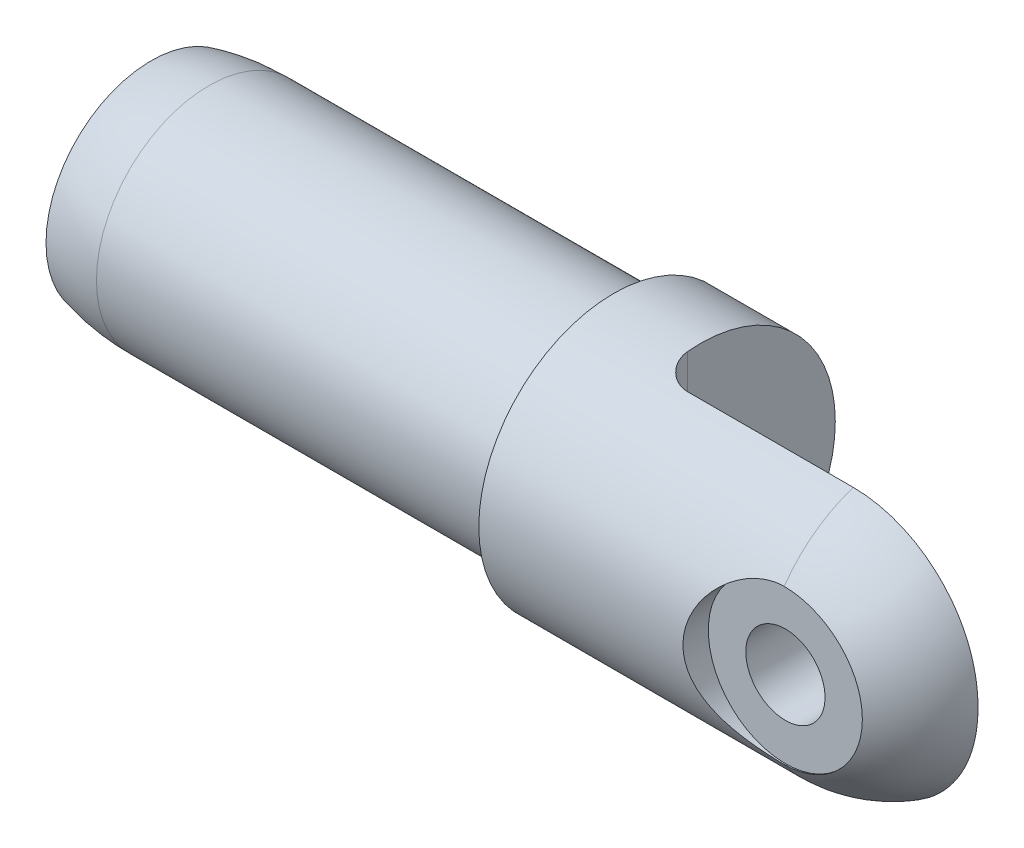
ISO-10303-21;
HEADER;
FILE_DESCRIPTION(('STEP AP214'),'2;1');
FILE_NAME('part.step','',(''),(''),'','','');
FILE_SCHEMA(('AUTOMOTIVE_DESIGN { 1 0 10303 214 1 1 1 1 }'));
ENDSEC;
DATA;
#1=APPLICATION_CONTEXT('core data for automotive mechanical design processes');
#2=APPLICATION_PROTOCOL_DEFINITION('international standard','automotive_design',2000,#1);
#3=PRODUCT_CONTEXT('',#1,'mechanical');
#4=PRODUCT('Part','Part','',(#3));
#5=PRODUCT_RELATED_PRODUCT_CATEGORY('part','',(#4));
#6=PRODUCT_DEFINITION_FORMATION('','',#4);
#7=PRODUCT_DEFINITION_CONTEXT('part definition',#1,'design');
#8=PRODUCT_DEFINITION('design','',#6,#7);
#9=PRODUCT_DEFINITION_SHAPE('','',#8);
#10=(LENGTH_UNIT() NAMED_UNIT(*) SI_UNIT(.MILLI.,.METRE.));
#11=(NAMED_UNIT(*) PLANE_ANGLE_UNIT() SI_UNIT($,.RADIAN.));
#12=(NAMED_UNIT(*) SI_UNIT($,.STERADIAN.) SOLID_ANGLE_UNIT());
#13=UNCERTAINTY_MEASURE_WITH_UNIT(LENGTH_MEASURE(1.E-05),#10,'distance_accuracy_value','');
#14=(GEOMETRIC_REPRESENTATION_CONTEXT(3) GLOBAL_UNCERTAINTY_ASSIGNED_CONTEXT((#13)) GLOBAL_UNIT_ASSIGNED_CONTEXT((#10,
#11,#12)) REPRESENTATION_CONTEXT('',''));
#15=CARTESIAN_POINT('',(0.,0.,0.));
#16=DIRECTION('',(0.,0.,1.));
#17=DIRECTION('',(1.,0.,0.));
#18=AXIS2_PLACEMENT_3D('',#15,#16,#17);
#19=CARTESIAN_POINT('',(4.11479999999999,0.,28.829));
#20=DIRECTION('',(0.,0.,-1.));
#21=DIRECTION('',(-1.,0.,0.));
#22=AXIS2_PLACEMENT_3D('',#19,#20,#21);
#23=CYLINDRICAL_SURFACE('',#22,3.2639);
#24=CARTESIAN_POINT('',(4.11479999999999,0.,3.429));
#25=DIRECTION('',(0.,0.,-1.));
#26=DIRECTION('',(-1.,0.,0.));
#27=AXIS2_PLACEMENT_3D('',#24,#25,#26);
#28=CIRCLE('',#27,3.2639);
#29=CARTESIAN_POINT('',(0.850899999999988,0.,3.429));
#30=VERTEX_POINT('',#29);
#31=EDGE_CURVE('E70',#30,#30,#28,.T.);
#32=ORIENTED_EDGE('',*,*,#31,.T.);
#33=EDGE_LOOP('',(#32));
#34=FACE_BOUND('',#33,.T.);
#35=CARTESIAN_POINT('',(4.11479999999999,0.,9.017));
#36=DIRECTION('',(0.,0.,-1.));
#37=DIRECTION('',(-1.,0.,0.));
#38=AXIS2_PLACEMENT_3D('',#35,#36,#37);
#39=CIRCLE('',#38,3.2639);
#40=CARTESIAN_POINT('',(0.850899999999988,0.,9.017));
#41=VERTEX_POINT('',#40);
#42=EDGE_CURVE('E19',#41,#41,#39,.F.);
#43=ORIENTED_EDGE('',*,*,#42,.T.);
#44=EDGE_LOOP('',(#43));
#45=FACE_BOUND('',#44,.T.);
#46=ADVANCED_FACE('F16',(#34,#45),#23,.F.);
#47=CARTESIAN_POINT('',(4.11479999999999,0.,9.017));
#48=DIRECTION('',(0.,0.,-1.));
#49=DIRECTION('',(-1.,0.,0.));
#50=AXIS2_PLACEMENT_3D('',#47,#48,#49);
#51=PLANE('',#50);
#52=ORIENTED_EDGE('',*,*,#42,.F.);
#53=EDGE_LOOP('',(#52));
#54=FACE_BOUND('',#53,.T.);
#55=CARTESIAN_POINT('',(4.11479999999999,0.,9.017));
#56=DIRECTION('',(0.,0.,1.));
#57=DIRECTION('',(1.,0.,0.));
#58=AXIS2_PLACEMENT_3D('',#55,#56,#57);
#59=CIRCLE('',#58,6.35);
#60=CARTESIAN_POINT('',(10.4648,0.,9.017));
#61=VERTEX_POINT('',#60);
#62=EDGE_CURVE('E100',#61,#61,#59,.T.);
#63=ORIENTED_EDGE('',*,*,#62,.T.);
#64=EDGE_LOOP('',(#63));
#65=FACE_BOUND('',#64,.T.);
#66=ADVANCED_FACE('F271',(#54,#65),#51,.F.);
#67=CARTESIAN_POINT('',(-17.5305929065692,0.,0.));
#68=DIRECTION('',(-1.,0.,0.));
#69=DIRECTION('',(0.,0.,1.));
#70=AXIS2_PLACEMENT_3D('',#67,#68,#69);
#71=CONICAL_SURFACE('',#70,6.34999999999985,1.17809724509603);
#72=CARTESIAN_POINT('',(-14.9003367854998,-2.88657986402541E-12,0.));
#73=VERTEX_POINT('',#72);
#74=VERTEX_LOOP('',#73);
#75=FACE_BOUND('',#74,.T.);
#76=CARTESIAN_POINT('',(-17.5305929065692,0.,0.));
#77=DIRECTION('',(1.,0.,0.));
#78=DIRECTION('',(0.,1.,0.));
#79=AXIS2_PLACEMENT_3D('',#76,#77,#78);
#80=CIRCLE('',#79,6.35);
#81=CARTESIAN_POINT('',(-17.5305929065692,6.35,0.));
#82=VERTEX_POINT('',#81);
#83=EDGE_CURVE('E172',#82,#82,#80,.F.);
#84=ORIENTED_EDGE('',*,*,#83,.T.);
#85=EDGE_LOOP('',(#84));
#86=FACE_BOUND('',#85,.T.);
#87=ADVANCED_FACE('F264',(#75,#86),#71,.F.);
#88=CARTESIAN_POINT('',(-11.90625,-25.4,-11.1125));
#89=DIRECTION('',(-1.,0.,0.));
#90=DIRECTION('',(0.,0.,1.));
#91=AXIS2_PLACEMENT_3D('',#88,#89,#90);
#92=PLANE('',#91);
#93=CARTESIAN_POINT('',(-11.90625,0.,0.));
#94=DIRECTION('',(-1.,0.,0.));
#95=DIRECTION('',(0.,0.,1.));
#96=AXIS2_PLACEMENT_3D('',#93,#94,#95);
#97=CIRCLE('',#96,11.1125);
#98=CARTESIAN_POINT('',(-11.90625,11.0629958052735,1.04774999999999));
#99=VERTEX_POINT('',#98);
#100=CARTESIAN_POINT('',(-11.90625,-11.0629958052735,1.04774999999998));
#101=VERTEX_POINT('',#100);
#102=EDGE_CURVE('E56',#99,#101,#97,.T.);
#103=ORIENTED_EDGE('',*,*,#102,.F.);
#104=DIRECTION('',(0.,1.,0.));
#105=VECTOR('',#104,1.);
#106=CARTESIAN_POINT('',(-11.90625,-25.4,1.04774999999998));
#107=LINE('',#106,#105);
#108=EDGE_CURVE('E64',#99,#101,#107,.F.);
#109=ORIENTED_EDGE('',*,*,#108,.T.);
#110=EDGE_LOOP('',(#103,#109));
#111=FACE_BOUND('',#110,.T.);
#112=ADVANCED_FACE('F66',(#111),#92,.F.);
#113=CARTESIAN_POINT('',(-9.525,-25.4,1.04775));
#114=DIRECTION('',(0.,1.,0.));
#115=DIRECTION('',(0.,0.,1.));
#116=AXIS2_PLACEMENT_3D('',#113,#114,#115);
#117=CYLINDRICAL_SURFACE('',#116,2.38125);
#118=ORIENTED_EDGE('',*,*,#108,.F.);
#119=CARTESIAN_POINT('',(-9.52499999999999,10.5702230463695,3.429));
#120=CARTESIAN_POINT('',(-9.59007757506837,10.5702157475828,3.42900820434887));
#121=CARTESIAN_POINT('',(-9.6551501934471,10.5710883130505,3.42633237813806));
#122=CARTESIAN_POINT('',(-9.78480089868392,10.574538719269,3.41567627561368));
#123=CARTESIAN_POINT('',(-9.8493790861965,10.5771162030687,3.40769710963494));
#124=CARTESIAN_POINT('',(-9.9774207812697,10.5839133732613,3.38652486966489));
#125=CARTESIAN_POINT('',(-10.040886707726,10.5881288629019,3.37334511882147));
#126=CARTESIAN_POINT('',(-10.1664067976909,10.5980944906147,3.34190357483902));
#127=CARTESIAN_POINT('',(-10.2284609303989,10.6038446621339,3.32364167093872));
#128=CARTESIAN_POINT('',(-10.4118261314781,10.6232034483166,3.26145883172233));
#129=CARTESIAN_POINT('',(-10.5304929254081,10.6389289097294,3.21011519315255));
#130=CARTESIAN_POINT('',(-10.7574606923266,10.674632334318,3.08930796096303));
#131=CARTESIAN_POINT('',(-10.8657571979252,10.6946121183613,3.01983660572699));
#132=CARTESIAN_POINT('',(-11.0723438695848,10.7378048676684,2.86252103470934));
#133=CARTESIAN_POINT('',(-11.1702675157826,10.7610928867535,2.77421554993913));
#134=CARTESIAN_POINT('',(-11.3501554532057,10.8086281716024,2.58281333569098));
#135=CARTESIAN_POINT('',(-11.432114988931,10.8328757206175,2.47971221462246));
#136=CARTESIAN_POINT('',(-11.5804798993483,10.8813670606136,2.25761808954577));
#137=CARTESIAN_POINT('',(-11.6462702287031,10.9055833588378,2.13820755936796));
#138=CARTESIAN_POINT('',(-11.7566403436888,10.9514037323377,1.88953875881115));
#139=CARTESIAN_POINT('',(-11.801235373844,10.9730096767192,1.7602876440474));
#140=CARTESIAN_POINT('',(-11.8582273537423,11.0066031116874,1.53345035197193));
#141=CARTESIAN_POINT('',(-11.8761838833356,11.0195747621923,1.43737154991012));
#142=CARTESIAN_POINT('',(-11.9002035242033,11.0431429738679,1.24350721882319));
#143=CARTESIAN_POINT('',(-11.9062728331179,11.053740770141,1.14572260600214));
#144=CARTESIAN_POINT('',(-11.90625,11.0629958052735,1.04774999999998));
#145=B_SPLINE_CURVE_WITH_KNOTS('',3,(#119,#120,#121,#122,#123,#124,#125,#126,#127,#128,#129,
#130,#131,#132,#133,#134,#135,#136,#137,#138,#139,#140,#141,#142,#143,#144),.UNSPECIFIED.,.F.,
.F.,(4,2,2,2,2,2,2,2,2,2,2,2,4),(0.,0.195163419909471,0.390285992254967,0.58491190075931,
0.779542051304854,1.16834236475339,1.55730942201975,1.95720233749974,2.35721419428481,
2.77066448351295,3.1838169507173,3.47889268061809,3.77381452588801),.UNSPECIFIED.);
#146=CARTESIAN_POINT('',(-9.52499999999999,10.5702230463695,3.429));
#147=VERTEX_POINT('',#146);
#148=EDGE_CURVE('E84',#147,#99,#145,.T.);
#149=ORIENTED_EDGE('',*,*,#148,.F.);
#150=DIRECTION('',(0.,1.,0.));
#151=VECTOR('',#150,1.);
#152=CARTESIAN_POINT('',(-9.52499999999999,-25.4,3.429));
#153=LINE('',#152,#151);
#154=CARTESIAN_POINT('',(-9.525,-10.5702230463695,3.429));
#155=VERTEX_POINT('',#154);
#156=EDGE_CURVE('E75',#147,#155,#153,.F.);
#157=ORIENTED_EDGE('',*,*,#156,.T.);
#158=CARTESIAN_POINT('',(-11.90625,-11.0629958052735,1.04774999999998));
#159=CARTESIAN_POINT('',(-11.9062503142858,-11.05663096206,1.11499195804934));
#160=CARTESIAN_POINT('',(-11.9034002135737,-11.049648757972,1.18213996736892));
#161=CARTESIAN_POINT('',(-11.8920647068507,-11.0345277624069,1.3158136794342));
#162=CARTESIAN_POINT('',(-11.8835804651633,-11.0263892101679,1.38233950787682));
#163=CARTESIAN_POINT('',(-11.8498349213216,-11.0003995321499,1.58001133523658));
#164=CARTESIAN_POINT('',(-11.8162800046308,-10.9809385541079,1.70962574663156));
#165=CARTESIAN_POINT('',(-11.7282515623074,-10.9388728295633,1.96086384995411));
#166=CARTESIAN_POINT('',(-11.6737834914026,-10.9162689038081,2.08248961586172));
#167=CARTESIAN_POINT('',(-11.5455335808344,-10.8693808252532,2.31479260695312));
#168=CARTESIAN_POINT('',(-11.4717455735568,-10.845096137719,2.42546632027547));
#169=CARTESIAN_POINT('',(-11.3051331874942,-10.7960916480259,2.63512866484038));
#170=CARTESIAN_POINT('',(-11.2119542128542,-10.7713729714463,2.73383592742652));
#171=CARTESIAN_POINT('',(-11.0098838607054,-10.7239701957526,2.91424756683147));
#172=CARTESIAN_POINT('',(-10.9009901123699,-10.7012864044726,2.99594937355288));
#173=CARTESIAN_POINT('',(-10.6703312526755,-10.6599424055754,3.13989031804794));
#174=CARTESIAN_POINT('',(-10.5485673354548,-10.6412818251584,3.20213125934963));
#175=CARTESIAN_POINT('',(-10.2955843570897,-10.6097878558335,3.30499270998591));
#176=CARTESIAN_POINT('',(-10.1643760027822,-10.5969479850908,3.34563727736996));
#177=CARTESIAN_POINT('',(-9.94761988754249,-10.5819352597564,3.39273567603477));
#178=CARTESIAN_POINT('',(-9.8637070188251,-10.5775623614962,3.40631529345634));
#179=CARTESIAN_POINT('',(-9.69487901693024,-10.5716990322974,3.42445095877389));
#180=CARTESIAN_POINT('',(-9.60996470253129,-10.5702063913584,3.42901392514501));
#181=CARTESIAN_POINT('',(-9.52499999999999,-10.5702230463695,3.429));
#182=B_SPLINE_CURVE_WITH_KNOTS('',3,(#158,#159,#160,#161,#162,#163,#164,#165,#166,#167,#168,
#169,#170,#171,#172,#173,#174,#175,#176,#177,#178,#179,#180,#181),.UNSPECIFIED.,.F.,.F.,(4,2,2,
2,2,2,2,2,2,2,2,4),(0.,0.202496246548069,0.404950659247399,0.808746853576956,1.21243779818405,
1.61625777283146,2.02823917714403,2.44028280059018,2.85228822672972,3.26383371737793,
3.51869225766275,3.77335516897302),.UNSPECIFIED.);
#183=EDGE_CURVE('E73',#101,#155,#182,.T.);
#184=ORIENTED_EDGE('',*,*,#183,.F.);
#185=EDGE_LOOP('',(#118,#149,#157,#184));
#186=FACE_BOUND('',#185,.T.);
#187=ADVANCED_FACE('F74',(#186),#117,.F.);
#188=CARTESIAN_POINT('',(14.3924863702392,-25.4,3.429));
#189=DIRECTION('',(0.,0.,1.));
#190=DIRECTION('',(1.,0.,0.));
#191=AXIS2_PLACEMENT_3D('',#188,#189,#190);
#192=PLANE('',#191);
#193=DIRECTION('',(-1.,0.,0.));
#194=VECTOR('',#193,1.);
#195=CARTESIAN_POINT('',(-57.15,10.5702230463695,3.429));
#196=LINE('',#195,#194);
#197=CARTESIAN_POINT('',(4.11479999999999,10.5702230463695,3.429));
#198=VERTEX_POINT('',#197);
#199=EDGE_CURVE('E86',#198,#147,#196,.T.);
#200=ORIENTED_EDGE('',*,*,#199,.F.);
#201=CARTESIAN_POINT('',(4.11479999999999,-10.5702230463695,3.42899999999999));
#202=CARTESIAN_POINT('',(4.40165968660357,-10.5702542669847,3.429));
#203=CARTESIAN_POINT('',(4.68851475117698,-10.5581144678676,3.429));
#204=CARTESIAN_POINT('',(5.26016903204297,-10.5097183984142,3.429));
#205=CARTESIAN_POINT('',(5.54496835385256,-10.473463374889,3.429));
#206=CARTESIAN_POINT('',(6.11026636516995,-10.3771012914387,3.429));
#207=CARTESIAN_POINT('',(6.39076834076853,-10.3170135096682,3.429));
#208=CARTESIAN_POINT('',(6.94571132720622,-10.1734279497175,3.429));
#209=CARTESIAN_POINT('',(7.22015240815029,-10.0899304424654,3.42899999999999));
#210=CARTESIAN_POINT('',(7.76115395037299,-9.90007853714298,3.42899999999999));
#211=CARTESIAN_POINT('',(8.0277107086402,-9.7937135869651,3.429));
#212=CARTESIAN_POINT('',(8.5509207277925,-9.55891521940781,3.429));
#213=CARTESIAN_POINT('',(8.80757397322663,-9.43048176759996,3.429));
#214=CARTESIAN_POINT('',(9.30911695395701,-9.15249427527941,3.429));
#215=CARTESIAN_POINT('',(9.55400871286386,-9.00294388559206,3.429));
#216=CARTESIAN_POINT('',(10.0303486024474,-8.6837822397422,3.429));
#217=CARTESIAN_POINT('',(10.2617967898724,-8.51417106826999,3.429));
#218=CARTESIAN_POINT('',(10.7098566926984,-8.15592413043585,3.429));
#219=CARTESIAN_POINT('',(10.9264529963244,-7.96726908936299,3.429));
#220=CARTESIAN_POINT('',(11.3430397319011,-7.57243862979385,3.429));
#221=CARTESIAN_POINT('',(11.5430301139773,-7.36626315868009,3.429));
#222=CARTESIAN_POINT('',(11.9250582161698,-6.93784480290657,3.429));
#223=CARTESIAN_POINT('',(12.1070931025427,-6.7155993916438,3.429));
#224=CARTESIAN_POINT('',(12.4519464452319,-6.25667422774999,3.429));
#225=CARTESIAN_POINT('',(12.6147650307728,-6.0199945722017,3.42899999999999));
#226=CARTESIAN_POINT('',(12.9209264615868,-5.53263777178276,3.42899999999999));
#227=CARTESIAN_POINT('',(13.0641634776673,-5.28189415657338,3.429));
#228=CARTESIAN_POINT('',(13.3292837928434,-4.76935429997244,3.429));
#229=CARTESIAN_POINT('',(13.4511663254719,-4.50755766227785,3.429));
#230=CARTESIAN_POINT('',(13.6728765928904,-3.97494112403004,3.429));
#231=CARTESIAN_POINT('',(13.7727145310807,-3.70412546503607,3.429));
#232=CARTESIAN_POINT('',(13.9500298915372,-3.15530997529808,3.429));
#233=CARTESIAN_POINT('',(14.0275106924218,-2.8773112369891,3.429));
#234=CARTESIAN_POINT('',(14.144000761436,-2.38415885849262,3.429));
#235=CARTESIAN_POINT('',(14.1877830557638,-2.17011616363708,3.429));
#236=CARTESIAN_POINT('',(14.2626195594898,-1.73981924070847,3.429));
#237=CARTESIAN_POINT('',(14.2936740885204,-1.52356506831208,3.429));
#238=CARTESIAN_POINT('',(14.3432163652892,-1.08976886113074,3.429));
#239=CARTESIAN_POINT('',(14.3617123232824,-0.872227761712938,3.429));
#240=CARTESIAN_POINT('',(14.3863456522571,-0.436468474403662,3.429));
#241=CARTESIAN_POINT('',(14.3924831050723,-0.218250291005173,3.429));
#242=CARTESIAN_POINT('',(14.3924917436325,0.359168368235225,3.429));
#243=CARTESIAN_POINT('',(14.3758842894535,0.718423691445449,3.429));
#244=CARTESIAN_POINT('',(14.3088929867436,1.43393980071099,3.429));
#245=CARTESIAN_POINT('',(14.2584945050238,1.79019922168611,3.429));
#246=CARTESIAN_POINT('',(14.1340944808747,2.43873442118711,3.429));
#247=CARTESIAN_POINT('',(14.0652554100939,2.7320050653158,3.429));
#248=CARTESIAN_POINT('',(13.9031387336199,3.31181801287049,3.429));
#249=CARTESIAN_POINT('',(13.8098550632279,3.59835862732778,3.429));
#250=CARTESIAN_POINT('',(13.5990120314003,4.16267192989558,3.429));
#251=CARTESIAN_POINT('',(13.4814305276417,4.44043635230689,3.429));
#252=CARTESIAN_POINT('',(13.2226570398721,4.98472807794138,3.429));
#253=CARTESIAN_POINT('',(13.0814665572953,5.25125609440504,3.429));
#254=CARTESIAN_POINT('',(12.7779629229675,5.76827349609684,3.429));
#255=CARTESIAN_POINT('',(12.6158851327536,6.01890103617935,3.429));
#256=CARTESIAN_POINT('',(12.2705978457698,6.50516088144595,3.429));
#257=CARTESIAN_POINT('',(12.0873880489295,6.74079297362383,3.429));
#258=CARTESIAN_POINT('',(11.7012239560847,7.19514789430687,3.429));
#259=CARTESIAN_POINT('',(11.4982762039422,7.41387628414577,3.429));
#260=CARTESIAN_POINT('',(11.0740878296009,7.83280568308689,3.429));
#261=CARTESIAN_POINT('',(10.8528476719938,8.03300716246309,3.429));
#262=CARTESIAN_POINT('',(10.4007596821611,8.40751011476593,3.429));
#263=CARTESIAN_POINT('',(10.1704124762138,8.58241635516515,3.429));
#264=CARTESIAN_POINT('',(9.69572902425788,8.91207920814252,3.429));
#265=CARTESIAN_POINT('',(9.45139310695082,9.06683629389846,3.429));
#266=CARTESIAN_POINT('',(8.95043801593031,9.35509516622299,3.429));
#267=CARTESIAN_POINT('',(8.69381693626368,9.48859364068318,3.429));
#268=CARTESIAN_POINT('',(8.17017042465508,9.7333319176702,3.429));
#269=CARTESIAN_POINT('',(7.90314487237041,9.84457146264911,3.429));
#270=CARTESIAN_POINT('',(7.3511985739832,10.0474358962125,3.429));
#271=CARTESIAN_POINT('',(7.06597836705986,10.1382471017149,3.429));
#272=CARTESIAN_POINT('',(6.48865116990716,10.2944612702724,3.429));
#273=CARTESIAN_POINT('',(6.19654386176869,10.3598630579817,3.429));
#274=CARTESIAN_POINT('',(5.60733488091136,10.464797566013,3.429));
#275=CARTESIAN_POINT('',(5.31022732563008,10.5042972606353,3.429));
#276=CARTESIAN_POINT('',(4.71368167088168,10.5570290073484,3.429));
#277=CARTESIAN_POINT('',(4.41424349788154,10.5702602272454,3.429));
#278=CARTESIAN_POINT('',(4.11479999999999,10.5702230463695,3.429));
#279=B_SPLINE_CURVE_WITH_KNOTS('',3,(#201,#202,#203,#204,#205,#206,#207,#208,#209,#210,#211,
#212,#213,#214,#215,#216,#217,#218,#219,#220,#221,#222,#223,#224,#225,#226,#227,#228,#229,#230,
#231,#232,#233,#234,#235,#236,#237,#238,#239,#240,#241,#242,#243,#244,#245,#246,#247,#248,#249,
#250,#251,#252,#253,#254,#255,#256,#257,#258,#259,#260,#261,#262,#263,#264,#265,#266,#267,#268,
#269,#270,#271,#272,#273,#274,#275,#276,#277,#278),.UNSPECIFIED.,.F.,.F.,(4,2,2,2,2,2,2,2,2,2,2,
2,2,2,2,2,2,2,2,2,2,2,2,2,2,2,2,2,2,2,2,2,2,2,2,2,2,2,4),(0.,0.860315744735405,1.7205870126791,
2.58016382763194,3.4397306948461,4.29969506103299,5.15966076883799,6.01947798213552,
6.87929156568523,7.73998428064422,8.60067958053258,9.46151049908485,10.3223356284453,
11.1876432587396,12.0529819407878,12.9179192549652,13.7827257909746,14.4377828883006,
15.0928235341626,15.7474355291582,16.4020431895328,17.4793126132215,18.5570488495088,
19.4597570237978,20.362689372142,21.2664482094375,22.1701495932272,23.0644369107593,
23.9587369285625,24.8527414570636,25.7467232865588,26.6133697069945,27.479995771646,
28.3467567254966,29.2135277076627,30.1103474836706,31.0072087383095,31.9052112974357,
32.8032423051164),.UNSPECIFIED.);
#280=CARTESIAN_POINT('',(4.11479999999999,-10.5702230463695,3.429));
#281=VERTEX_POINT('',#280);
#282=EDGE_CURVE('E45',#281,#198,#279,.T.);
#283=ORIENTED_EDGE('',*,*,#282,.F.);
#284=DIRECTION('',(-1.,0.,0.));
#285=VECTOR('',#284,1.);
#286=CARTESIAN_POINT('',(-57.15,-10.5702230463695,3.429));
#287=LINE('',#286,#285);
#288=EDGE_CURVE('E79',#155,#281,#287,.F.);
#289=ORIENTED_EDGE('',*,*,#288,.F.);
#290=ORIENTED_EDGE('',*,*,#156,.F.);
#291=EDGE_LOOP('',(#200,#283,#289,#290));
#292=FACE_BOUND('',#291,.T.);
#293=ORIENTED_EDGE('',*,*,#31,.F.);
#294=EDGE_LOOP('',(#293));
#295=FACE_BOUND('',#294,.T.);
#296=ADVANCED_FACE('F141',(#292,#295),#192,.F.);
#297=CARTESIAN_POINT('',(4.11479999999998,0.,0.396874999999999));
#298=DIRECTION('',(0.,1.,0.));
#299=DIRECTION('',(0.,0.,1.));
#300=AXIS2_PLACEMENT_3D('',#297,#298,#299);
#301=CIRCLE('',#300,10.715625);
#302=TRIMMED_CURVE('',#301,(PARAMETER_VALUE(-1.60784183660699)),
(PARAMETER_VALUE(1.60784183660699)),.T.,.PARAMETER.);
#303=CARTESIAN_POINT('',(4.11479999999998,0.,0.));
#304=DIRECTION('',(-1.,0.,0.));
#305=AXIS1_PLACEMENT('',#303,#304);
#306=SURFACE_OF_REVOLUTION('',#302,#305);
#307=CARTESIAN_POINT('',(4.11479999999999,6.34999999999999,9.11949320137912));
#308=CARTESIAN_POINT('',(4.29336021298781,6.35001923466306,9.1194946397849));
#309=CARTESIAN_POINT('',(4.47191762888058,6.34246921342302,9.11929902288398));
#310=CARTESIAN_POINT('',(4.82775451313722,6.31236960883699,9.11852401486109));
#311=CARTESIAN_POINT('',(5.00503404357307,6.28982075907454,9.11794464250838));
#312=CARTESIAN_POINT('',(5.35693570714954,6.2298836798212,9.11641300132261));
#313=CARTESIAN_POINT('',(5.53155963548152,6.19250598409405,9.11546099719728));
#314=CARTESIAN_POINT('',(5.87703653491204,6.10318364067847,9.11320451066068));
#315=CARTESIAN_POINT('',(6.04788955107782,6.05123916718356,9.11190003246441));
#316=CARTESIAN_POINT('',(6.38466376101032,5.93313330116117,9.10896596967149));
#317=CARTESIAN_POINT('',(6.55058345853274,5.86696764451125,9.10733628757524));
#318=CARTESIAN_POINT('',(6.87631878044994,5.7208729412379,9.10378734414069));
#319=CARTESIAN_POINT('',(7.03613213399613,5.64093883406532,9.10186797636158));
#320=CARTESIAN_POINT('',(7.34838683826885,5.46793025557099,9.09778476756792));
#321=CARTESIAN_POINT('',(7.5008313405531,5.37486146973727,9.09562103241098));
#322=CARTESIAN_POINT('',(7.79734308469577,5.17621693935109,9.09109972826269));
#323=CARTESIAN_POINT('',(7.94141014709172,5.07064092701447,9.08874215512153));
#324=CARTESIAN_POINT('',(8.22015728392766,4.84772046354233,9.08389152309223));
#325=CARTESIAN_POINT('',(8.35483625300749,4.73037463057418,9.08139844831133));
#326=CARTESIAN_POINT('',(8.6138326326601,4.48475830452535,9.07634227813275));
#327=CARTESIAN_POINT('',(8.73815003697446,4.35648780484624,9.07377918269278));
#328=CARTESIAN_POINT('',(8.97558750389792,4.08988035612624,9.0686527844017));
#329=CARTESIAN_POINT('',(9.0887031394057,3.95153946430133,9.06608948186612));
#330=CARTESIAN_POINT('',(9.30287541986637,3.66582174289506,9.0610388071297));
#331=CARTESIAN_POINT('',(9.40393231391045,3.51844510005578,9.05855143336124));
#332=CARTESIAN_POINT('',(9.59334669592494,3.21557960738187,9.05372788505043));
#333=CARTESIAN_POINT('',(9.68169405261612,3.06008441902103,9.05139183193826));
#334=CARTESIAN_POINT('',(9.84493471710065,2.74225484884581,9.04695084951367));
#335=CARTESIAN_POINT('',(9.91983290631086,2.57992297494488,9.04484583645283));
#336=CARTESIAN_POINT('',(10.0556228907626,2.24965999099767,9.04094086822662));
#337=CARTESIAN_POINT('',(10.1165267498227,2.08173384758559,9.03914065066718));
#338=CARTESIAN_POINT('',(10.223962599642,1.74140088218761,9.0359090236737));
#339=CARTESIAN_POINT('',(10.2704980435776,1.56899514760202,9.03447752563865));
#340=CARTESIAN_POINT('',(10.3611753287635,1.16627248752879,9.03165517957172));
#341=CARTESIAN_POINT('',(10.3999980316597,0.934737097151482,9.03041762161556));
#342=CARTESIAN_POINT('',(10.4518095059542,0.468785926322722,9.02875816734439));
#343=CARTESIAN_POINT('',(10.4647977619294,0.234370088497342,9.02833628730298));
#344=CARTESIAN_POINT('',(10.4648017029684,-0.178334346276048,9.0283357962919));
#345=CARTESIAN_POINT('',(10.4572847256569,-0.356642204480613,9.02857968394109));
#346=CARTESIAN_POINT('',(10.4272708249356,-0.712048587792949,9.02954502285182));
#347=CARTESIAN_POINT('',(10.4047703109932,-0.889146812755241,9.03026658857999));
#348=CARTESIAN_POINT('',(10.3449205422979,-1.24095296213089,9.03215967788938));
#349=CARTESIAN_POINT('',(10.3075596550775,-1.41565890281434,9.03333155394204));
#350=CARTESIAN_POINT('',(10.218239926485,-1.761364209099,9.03608012133331));
#351=CARTESIAN_POINT('',(10.1662757625657,-1.93236219871682,9.0376569602532));
#352=CARTESIAN_POINT('',(10.0481744142551,-2.26922872140831,9.04115465691044));
#353=CARTESIAN_POINT('',(9.98204898445259,-2.43510137889895,9.04307522911537));
#354=CARTESIAN_POINT('',(9.83604264941287,-2.76074904775144,9.04719325738053));
#355=CARTESIAN_POINT('',(9.75615661509811,-2.9205217582159,9.04939081660167));
#356=CARTESIAN_POINT('',(9.5832677155704,-3.23267280670186,9.05398603765447));
#357=CARTESIAN_POINT('',(9.4902729970317,-3.38505565884966,9.05638357483052));
#358=CARTESIAN_POINT('',(9.29174438242254,-3.68151971089567,9.06130397837));
#359=CARTESIAN_POINT('',(9.18620482402368,-3.8255971180861,9.06382690102707));
#360=CARTESIAN_POINT('',(8.96329963459932,-4.10444043190065,9.06892208649419));
#361=CARTESIAN_POINT('',(8.84592664673014,-4.23920045705792,9.07149437918308));
#362=CARTESIAN_POINT('',(8.60029934833327,-4.49829376460357,9.07661186072623));
#363=CARTESIAN_POINT('',(8.47204998358188,-4.62263173557275,9.07915706131365));
#364=CARTESIAN_POINT('',(8.20546906899901,-4.86012438744001,9.08415387617797));
#365=CARTESIAN_POINT('',(8.06713260900708,-4.97327355789752,9.08660544397989));
#366=CARTESIAN_POINT('',(7.78146972581167,-5.1874746146652,9.09134982537107));
#367=CARTESIAN_POINT('',(7.63414668099082,-5.28853100528755,9.09364269793604));
#368=CARTESIAN_POINT('',(7.33140241363462,-5.47794426795067,9.09801622671243));
#369=CARTESIAN_POINT('',(7.17597554073038,-5.56629211320329,9.10009673177912));
#370=CARTESIAN_POINT('',(6.85828541544906,-5.72954389774143,9.10399425681801));
#371=CARTESIAN_POINT('',(6.69602467896333,-5.80445273210169,9.10581137268155));
#372=CARTESIAN_POINT('',(6.36579434916114,-5.94031883949376,9.1091417478085));
#373=CARTESIAN_POINT('',(6.19782598586264,-6.00127909687722,9.11065507206078));
#374=CARTESIAN_POINT('',(5.85741457788779,-6.10881893199277,9.11334504154765));
#375=CARTESIAN_POINT('',(5.68497261778809,-6.15540196065823,9.11452176757018));
#376=CARTESIAN_POINT('',(5.281825284567,-6.24624627336825,9.11682776424876));
#377=CARTESIAN_POINT('',(5.04987769801229,-6.28515387596483,9.11782532256507));
#378=CARTESIAN_POINT('',(4.70009366961108,-6.32405755669483,9.11882485239718));
#379=CARTESIAN_POINT('',(4.58325139859289,-6.33378248745614,9.11907522640062));
#380=CARTESIAN_POINT('',(4.34921570548934,-6.3467529048538,9.1194094409669));
#381=CARTESIAN_POINT('',(4.23202230859598,-6.34999884568939,9.11949329320349));
#382=CARTESIAN_POINT('',(4.11479999999999,-6.35,9.11949320137912));
#383=B_SPLINE_CURVE_WITH_KNOTS('',3,(#307,#308,#309,#310,#311,#312,#313,#314,#315,#316,#317,
#318,#319,#320,#321,#322,#323,#324,#325,#326,#327,#328,#329,#330,#331,#332,#333,#334,#335,#336,
#337,#338,#339,#340,#341,#342,#343,#344,#345,#346,#347,#348,#349,#350,#351,#352,#353,#354,#355,
#356,#357,#358,#359,#360,#361,#362,#363,#364,#365,#366,#367,#368,#369,#370,#371,#372,#373,#374,
#375,#376,#377,#378,#379,#380,#381,#382),.UNSPECIFIED.,.F.,.F.,(4,2,2,2,2,2,2,2,2,2,2,2,2,2,2,2,
2,2,2,2,2,2,2,2,2,2,2,2,2,2,2,2,2,2,2,2,2,4),(0.,0.535517031355501,1.07100787282515,
1.60611900416649,2.14122373677483,2.67648914119134,3.21195170210855,3.74718318913139,
4.28242613772267,4.81773200008979,5.35303818578202,5.88855509492011,6.42406094024674,
6.95999132097504,7.49572678920089,8.03099867913615,8.56614182629892,9.2689698813817,
9.97181195844746,10.5066109302465,11.0415381030502,11.5768848351507,12.1124269420402,
12.647526232193,13.1828254066106,13.7177933626124,14.2530037091087,14.7885488721324,
15.3238518011353,15.8594170652641,16.3947822172508,16.9305257771685,17.4660737979261,
18.0015071287612,18.5368118406278,19.2407397488779,19.5923286654551,19.9438929335876),.UNSPECIFIED.);
#384=CARTESIAN_POINT('',(4.11479999999999,6.34999999999999,9.11949320137912));
#385=VERTEX_POINT('',#384);
#386=CARTESIAN_POINT('',(4.11479999999999,-6.35,9.11949320137911));
#387=VERTEX_POINT('',#386);
#388=EDGE_CURVE('E34',#385,#387,#383,.T.);
#389=ORIENTED_EDGE('',*,*,#388,.T.);
#390=CARTESIAN_POINT('',(4.11479999999999,0.,0.));
#391=DIRECTION('',(-1.,0.,0.));
#392=DIRECTION('',(0.,0.,1.));
#393=AXIS2_PLACEMENT_3D('',#390,#391,#392);
#394=CIRCLE('',#393,11.1125);
#395=EDGE_CURVE('E122',#281,#387,#394,.T.);
#396=ORIENTED_EDGE('',*,*,#395,.F.);
#397=ORIENTED_EDGE('',*,*,#282,.T.);
#398=CARTESIAN_POINT('',(4.11479999999999,0.,0.));
#399=DIRECTION('',(-1.,0.,0.));
#400=DIRECTION('',(0.,0.,1.));
#401=AXIS2_PLACEMENT_3D('',#398,#399,#400);
#402=CIRCLE('',#401,11.1125);
#403=EDGE_CURVE('E170',#385,#198,#402,.T.);
#404=ORIENTED_EDGE('',*,*,#403,.F.);
#405=EDGE_LOOP('',(#389,#396,#397,#404));
#406=FACE_BOUND('',#405,.T.);
#407=ADVANCED_FACE('F128',(#406),#306,.F.);
#408=CARTESIAN_POINT('',(4.11479999999999,0.,9.017));
#409=DIRECTION('',(0.,0.,1.));
#410=DIRECTION('',(1.,0.,0.));
#411=AXIS2_PLACEMENT_3D('',#408,#409,#410);
#412=CYLINDRICAL_SURFACE('',#411,6.35);
#413=ORIENTED_EDGE('',*,*,#388,.F.);
#414=CARTESIAN_POINT('',(4.11479999999999,-6.35,9.11949320137911));
#415=CARTESIAN_POINT('',(3.95245147831902,-6.35003519286683,9.11943048182426));
#416=CARTESIAN_POINT('',(3.7901350995733,-6.34377567787408,9.1238265282677));
#417=CARTESIAN_POINT('',(3.46703343699066,-6.31894035290302,9.14106458580629));
#418=CARTESIAN_POINT('',(3.30624696446664,-6.30037506080813,9.15389938413161));
#419=CARTESIAN_POINT('',(2.98855507299971,-6.25138010242326,9.18742194746135));
#420=CARTESIAN_POINT('',(2.83162988086414,-6.2210381131115,9.20805165036083));
#421=CARTESIAN_POINT('',(2.52152457443068,-6.14892797533445,9.2563617994105));
#422=CARTESIAN_POINT('',(2.3683451080343,-6.10715786515491,9.28404345602));
#423=CARTESIAN_POINT('',(2.06717315689365,-6.01286457967159,9.34538705161209));
#424=CARTESIAN_POINT('',(1.91916467519649,-5.96037879948081,9.37902814099676));
#425=CARTESIAN_POINT('',(1.62845594459035,-5.84508896320999,9.45130791300472));
#426=CARTESIAN_POINT('',(1.48575778936575,-5.78228088916351,9.48994854045388));
#427=CARTESIAN_POINT('',(1.06610174081408,-5.57894607622708,9.61186824936912));
#428=CARTESIAN_POINT('',(0.797910164280768,-5.42361274537789,9.70107430026862));
#429=CARTESIAN_POINT('',(0.260813102150916,-5.05826023783404,9.89692036539756));
#430=CARTESIAN_POINT('',(-0.00498658994943469,-4.84412682022318,10.004400921062));
#431=CARTESIAN_POINT('',(-0.375576637055676,-4.49310751043241,10.1644615930314));
#432=CARTESIAN_POINT('',(-0.494478369234897,-4.37105719398525,10.2176502134535));
#433=CARTESIAN_POINT('',(-0.722433483902645,-4.11737103538705,10.3224863778028));
#434=CARTESIAN_POINT('',(-0.831485281307482,-3.98573365658939,10.3741336728027));
#435=CARTESIAN_POINT('',(-1.04900099016503,-3.70038527562882,10.4795085508888));
#436=CARTESIAN_POINT('',(-1.15641046809246,-3.54576734348305,10.5329624161366));
#437=CARTESIAN_POINT('',(-1.3576451640528,-3.22651909983752,10.635097517204));
#438=CARTESIAN_POINT('',(-1.45147603154476,-3.06189299301659,10.6837807351413));
#439=CARTESIAN_POINT('',(-1.62455305890763,-2.72367101528932,10.7749674605877));
#440=CARTESIAN_POINT('',(-1.70381083842544,-2.55008243318784,10.8174758857519));
#441=CARTESIAN_POINT('',(-1.84681559071721,-2.19504825948408,10.8950633421832));
#442=CARTESIAN_POINT('',(-1.91056672420157,-2.01360479091433,10.9301443660266));
#443=CARTESIAN_POINT('',(-2.01027703062813,-1.68210374062236,10.985462291376));
#444=CARTESIAN_POINT('',(-2.04925324836555,-1.53320777043884,11.0072676249276));
#445=CARTESIAN_POINT('',(-2.11639185281486,-1.23227571076992,11.0450049590811));
#446=CARTESIAN_POINT('',(-2.14455597623116,-1.0802401297257,11.0609379029256));
#447=CARTESIAN_POINT('',(-2.18974342236131,-0.774060791566224,11.0865719593518));
#448=CARTESIAN_POINT('',(-2.20677109524749,-0.619917881675709,11.0962755052626));
#449=CARTESIAN_POINT('',(-2.22949992716548,-0.310518168652721,11.109239885208));
#450=CARTESIAN_POINT('',(-2.23520030767384,-0.155261289693234,11.1125002764053));
#451=CARTESIAN_POINT('',(-2.23519967493533,0.164037229841071,11.1124997079712));
#452=CARTESIAN_POINT('',(-2.22883600060636,0.328079383129707,11.1088597208518));
#453=CARTESIAN_POINT('',(-2.20346836533585,0.6548640679492,11.0943933554963));
#454=CARTESIAN_POINT('',(-2.18446391842137,0.817606549270889,11.0835667009697));
#455=CARTESIAN_POINT('',(-2.13406513780724,1.14057045949559,11.0550007284814));
#456=CARTESIAN_POINT('',(-2.10266858163059,1.30079143081259,11.0372601705448));
#457=CARTESIAN_POINT('',(-2.02786897100461,1.61759848301998,10.9952981312375));
#458=CARTESIAN_POINT('',(-1.98446093892674,1.77418302773017,10.971073963156));
#459=CARTESIAN_POINT('',(-1.88635815672554,2.08196249222761,10.9168397627607));
#460=CARTESIAN_POINT('',(-1.83171391417426,2.23317809682437,10.8868556601256));
#461=CARTESIAN_POINT('',(-1.71158296088921,2.53010849904803,10.8217077617134));
#462=CARTESIAN_POINT('',(-1.64609207868185,2.6758211537338,10.7865419737052));
#463=CARTESIAN_POINT('',(-1.43425205853039,3.10347751810646,10.6743943356217));
#464=CARTESIAN_POINT('',(-1.27245225697282,3.37619767218739,10.5907148215407));
#465=CARTESIAN_POINT('',(-0.899524302232207,3.91062262230077,10.4057917801407));
#466=CARTESIAN_POINT('',(-0.685684886219577,4.1701236362276,10.3037177793726));
#467=CARTESIAN_POINT('',(-0.220474367793522,4.6518887633142,10.0953685264426));
#468=CARTESIAN_POINT('',(0.0309448615448155,4.87410434045918,9.98908801740414));
#469=CARTESIAN_POINT('',(0.447521363862742,5.18731241047899,9.82829170156993));
#470=CARTESIAN_POINT('',(0.601299423345375,5.29270534371552,9.77178010180995));
#471=CARTESIAN_POINT('',(0.918526971376583,5.49010218289477,9.66225413807853));
#472=CARTESIAN_POINT('',(1.08197882542341,5.58210279487601,9.60924063624265));
#473=CARTESIAN_POINT('',(1.41730356027459,5.75162828631799,9.50873950743427));
#474=CARTESIAN_POINT('',(1.5891543609773,5.82918878914918,9.46123839371472));
#475=CARTESIAN_POINT('',(1.94060516051379,5.96917972223046,9.37354659236085));
#476=CARTESIAN_POINT('',(2.12019926686161,6.03162142625669,9.33335046316406));
#477=CARTESIAN_POINT('',(2.44773364092394,6.1291259389783,9.26952653377587));
#478=CARTESIAN_POINT('',(2.59445571700668,6.16718309231781,9.2441917032362));
#479=CARTESIAN_POINT('',(2.89116028688102,6.23283915898145,9.20005057494133));
#480=CARTESIAN_POINT('',(3.04114178938115,6.26044120623136,9.18124232098201));
#481=CARTESIAN_POINT('',(3.34438378481543,6.30496328683832,9.15073071866757));
#482=CARTESIAN_POINT('',(3.49765899938053,6.32181479476149,9.13907296639487));
#483=CARTESIAN_POINT('',(3.80554671415482,6.34435249518381,9.12342497113931));
#484=CARTESIAN_POINT('',(3.9601602587387,6.35002899298102,9.11944138582184));
#485=CARTESIAN_POINT('',(4.11479999999999,6.34999999999999,9.11949320137912));
#486=B_SPLINE_CURVE_WITH_KNOTS('',3,(#414,#415,#416,#417,#418,#419,#420,#421,#422,#423,#424,
#425,#426,#427,#428,#429,#430,#431,#432,#433,#434,#435,#436,#437,#438,#439,#440,#441,#442,#443,
#444,#445,#446,#447,#448,#449,#450,#451,#452,#453,#454,#455,#456,#457,#458,#459,#460,#461,#462,
#463,#464,#465,#466,#467,#468,#469,#470,#471,#472,#473,#474,#475,#476,#477,#478,#479,#480,#481,
#482,#483,#484,#485),.UNSPECIFIED.,.F.,.F.,(4,2,2,2,2,2,2,2,2,2,2,2,2,2,2,2,2,2,2,2,2,2,2,2,2,2,
2,2,2,2,2,2,2,2,2,4),(0.,0.486814545000233,0.973213539847835,1.45605870769001,1.9389868112302,
2.42025756680202,2.90171610328713,3.86567559786668,4.93466035610752,5.46973123871397,
6.00488807383573,6.59124502858293,7.17735732040123,7.76300023786519,8.34848584309138,
8.8143489085206,9.28013711284772,9.74574325996674,10.2113814070347,10.7033391378011,
11.1953157829146,11.687380702264,12.1796498424791,12.6697527608309,13.1600446058174,
14.1398118027008,15.1900617221904,16.2416683640788,16.8254745964612,17.4094241794747,
17.9919135117631,18.5739671467923,19.0345192800438,19.4949332529989,19.9582533948281,
20.4219753058435),.UNSPECIFIED.);
#487=EDGE_CURVE('E115',#387,#385,#486,.T.);
#488=ORIENTED_EDGE('',*,*,#487,.F.);
#489=EDGE_LOOP('',(#413,#488));
#490=FACE_BOUND('',#489,.T.);
#491=ORIENTED_EDGE('',*,*,#62,.F.);
#492=EDGE_LOOP('',(#491));
#493=FACE_BOUND('',#492,.T.);
#494=ADVANCED_FACE('F124',(#490,#493),#412,.F.);
#495=CARTESIAN_POINT('',(-14.9003367855,0.,0.));
#496=DIRECTION('',(1.,0.,0.));
#497=DIRECTION('',(0.,1.,0.));
#498=AXIS2_PLACEMENT_3D('',#495,#496,#497);
#499=CYLINDRICAL_SURFACE('',#498,6.35);
#500=CARTESIAN_POINT('',(-57.15,0.,0.));
#501=DIRECTION('',(1.,0.,0.));
#502=DIRECTION('',(0.,1.,0.));
#503=AXIS2_PLACEMENT_3D('',#500,#501,#502);
#504=CIRCLE('',#503,6.35);
#505=CARTESIAN_POINT('',(-57.15,6.35,0.));
#506=VERTEX_POINT('',#505);
#507=EDGE_CURVE('E121',#506,#506,#504,.F.);
#508=ORIENTED_EDGE('',*,*,#507,.T.);
#509=EDGE_LOOP('',(#508));
#510=FACE_BOUND('',#509,.T.);
#511=ORIENTED_EDGE('',*,*,#83,.F.);
#512=EDGE_LOOP('',(#511));
#513=FACE_BOUND('',#512,.T.);
#514=ADVANCED_FACE('F110',(#510,#513),#499,.F.);
#515=CARTESIAN_POINT('',(-57.15,0.,0.));
#516=DIRECTION('',(-1.,0.,0.));
#517=DIRECTION('',(0.,0.,1.));
#518=AXIS2_PLACEMENT_3D('',#515,#516,#517);
#519=CYLINDRICAL_SURFACE('',#518,11.1125);
#520=ORIENTED_EDGE('',*,*,#148,.T.);
#521=ORIENTED_EDGE('',*,*,#102,.T.);
#522=ORIENTED_EDGE('',*,*,#183,.T.);
#523=ORIENTED_EDGE('',*,*,#288,.T.);
#524=ORIENTED_EDGE('',*,*,#395,.T.);
#525=ORIENTED_EDGE('',*,*,#487,.T.);
#526=ORIENTED_EDGE('',*,*,#403,.T.);
#527=ORIENTED_EDGE('',*,*,#199,.T.);
#528=EDGE_LOOP('',(#520,#521,#522,#523,#524,#525,#526,#527));
#529=FACE_BOUND('',#528,.T.);
#530=CARTESIAN_POINT('',(-19.05,0.,0.));
#531=DIRECTION('',(-1.,0.,0.));
#532=DIRECTION('',(0.,0.,1.));
#533=AXIS2_PLACEMENT_3D('',#530,#531,#532);
#534=CIRCLE('',#533,11.1125);
#535=CARTESIAN_POINT('',(-19.05,0.,11.1125));
#536=VERTEX_POINT('',#535);
#537=EDGE_CURVE('E182',#536,#536,#534,.T.);
#538=ORIENTED_EDGE('',*,*,#537,.F.);
#539=EDGE_LOOP('',(#538));
#540=FACE_BOUND('',#539,.T.);
#541=ADVANCED_FACE('F81',(#529,#540),#519,.T.);
#542=CARTESIAN_POINT('',(-57.15,14.2875,0.));
#543=DIRECTION('',(1.,0.,0.));
#544=DIRECTION('',(0.,0.,-1.));
#545=AXIS2_PLACEMENT_3D('',#542,#543,#544);
#546=PLANE('',#545);
#547=ORIENTED_EDGE('',*,*,#507,.F.);
#548=EDGE_LOOP('',(#547));
#549=FACE_BOUND('',#548,.T.);
#550=CARTESIAN_POINT('',(-57.15,0.,0.));
#551=DIRECTION('',(-1.,0.,0.));
#552=DIRECTION('',(0.,0.,1.));
#553=AXIS2_PLACEMENT_3D('',#550,#551,#552);
#554=CIRCLE('',#553,8.66608318631283);
#555=CARTESIAN_POINT('',(-57.15,0.,8.66608318631283));
#556=VERTEX_POINT('',#555);
#557=EDGE_CURVE('E180',#556,#556,#554,.F.);
#558=ORIENTED_EDGE('',*,*,#557,.F.);
#559=EDGE_LOOP('',(#558));
#560=FACE_BOUND('',#559,.T.);
#561=ADVANCED_FACE('F109',(#549,#560),#546,.F.);
#562=CARTESIAN_POINT('',(-19.05,0.,-9.271));
#563=DIRECTION('',(-1.,0.,0.));
#564=DIRECTION('',(0.,0.,1.));
#565=AXIS2_PLACEMENT_3D('',#562,#563,#564);
#566=PLANE('',#565);
#567=ORIENTED_EDGE('',*,*,#537,.T.);
#568=EDGE_LOOP('',(#567));
#569=FACE_BOUND('',#568,.T.);
#570=CARTESIAN_POINT('',(-19.05,0.,0.));
#571=DIRECTION('',(-1.,0.,0.));
#572=DIRECTION('',(0.,0.,1.));
#573=AXIS2_PLACEMENT_3D('',#570,#571,#572);
#574=CIRCLE('',#573,9.271);
#575=CARTESIAN_POINT('',(-19.05,0.,9.271));
#576=VERTEX_POINT('',#575);
#577=EDGE_CURVE('E25',#576,#576,#574,.T.);
#578=ORIENTED_EDGE('',*,*,#577,.F.);
#579=EDGE_LOOP('',(#578));
#580=FACE_BOUND('',#579,.T.);
#581=ADVANCED_FACE('F159',(#569,#580),#566,.T.);
#582=CARTESIAN_POINT('',(-52.3875,0.,-9.77900000000001));
#583=DIRECTION('',(0.,1.,0.));
#584=DIRECTION('',(0.,0.,1.));
#585=AXIS2_PLACEMENT_3D('',#582,#583,#584);
#586=CIRCLE('',#585,19.05);
#587=TRIMMED_CURVE('',#586,(PARAMETER_VALUE(-1.0317318815494)),
(PARAMETER_VALUE(1.0317318815494)),.T.,.PARAMETER.);
#588=CARTESIAN_POINT('',(-52.3875,0.,0.));
#589=DIRECTION('',(-1.,0.,0.));
#590=AXIS1_PLACEMENT('',#588,#589);
#591=SURFACE_OF_REVOLUTION('',#587,#590);
#592=ORIENTED_EDGE('',*,*,#557,.T.);
#593=EDGE_LOOP('',(#592));
#594=FACE_BOUND('',#593,.T.);
#595=CARTESIAN_POINT('',(-52.3875,0.,0.));
#596=DIRECTION('',(-1.,0.,0.));
#597=DIRECTION('',(0.,0.,1.));
#598=AXIS2_PLACEMENT_3D('',#595,#596,#597);
#599=CIRCLE('',#598,9.271);
#600=CARTESIAN_POINT('',(-52.3875,0.,9.271));
#601=VERTEX_POINT('',#600);
#602=EDGE_CURVE('E11',#601,#601,#599,.F.);
#603=ORIENTED_EDGE('',*,*,#602,.F.);
#604=EDGE_LOOP('',(#603));
#605=FACE_BOUND('',#604,.T.);
#606=ADVANCED_FACE('F153',(#594,#605),#591,.F.);
#607=CARTESIAN_POINT('',(-57.15,0.,0.));
#608=DIRECTION('',(-1.,0.,0.));
#609=DIRECTION('',(0.,0.,1.));
#610=AXIS2_PLACEMENT_3D('',#607,#608,#609);
#611=CYLINDRICAL_SURFACE('',#610,9.271);
#612=ORIENTED_EDGE('',*,*,#602,.T.);
#613=EDGE_LOOP('',(#612));
#614=FACE_BOUND('',#613,.T.);
#615=ORIENTED_EDGE('',*,*,#577,.T.);
#616=EDGE_LOOP('',(#615));
#617=FACE_BOUND('',#616,.T.);
#618=ADVANCED_FACE('F151',(#614,#617),#611,.T.);
#619=CLOSED_SHELL('',(#46,#66,#87,#112,#187,#296,#407,#494,#514,#541,#561,#581,#606,#618));
#620=MANIFOLD_SOLID_BREP('B1',#619);
#621=ADVANCED_BREP_SHAPE_REPRESENTATION('',(#18,#620),#14);
#622=SHAPE_DEFINITION_REPRESENTATION(#9,#621);
ENDSEC;
END-ISO-10303-21;
